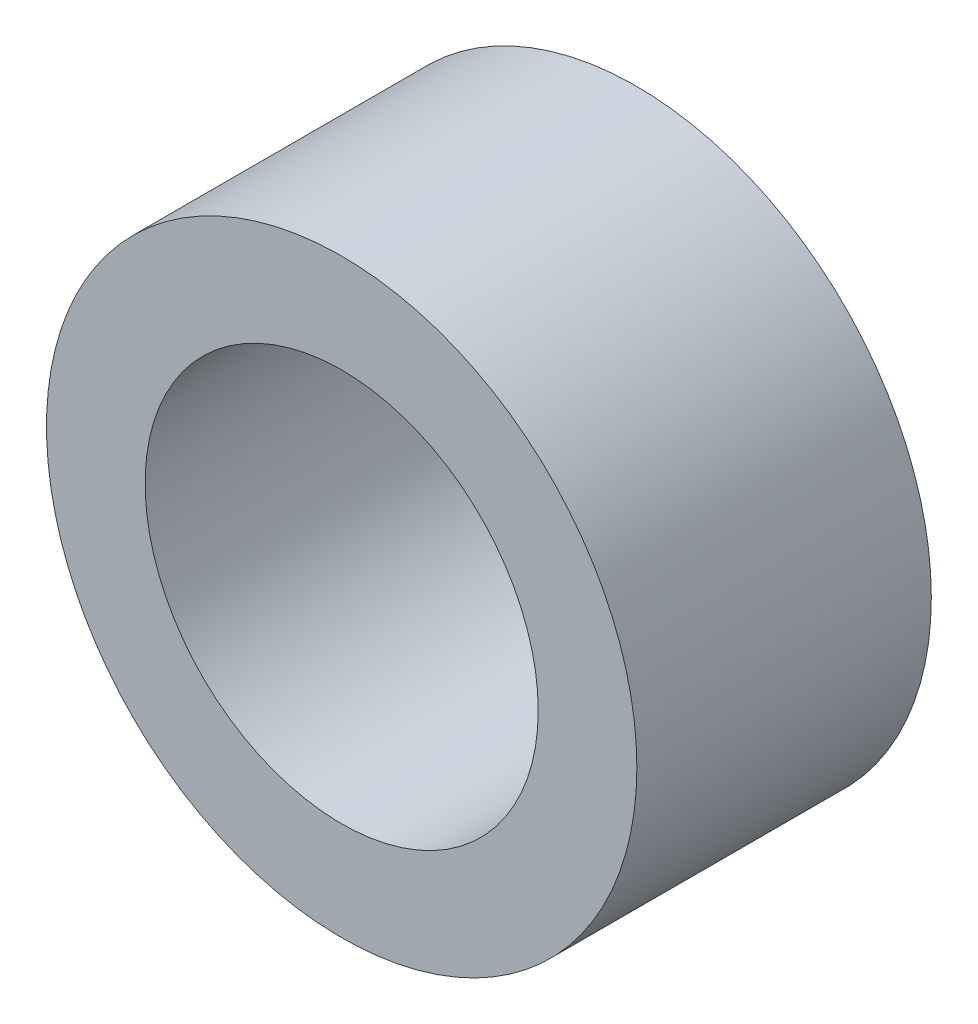
ISO-10303-21;
HEADER;
FILE_DESCRIPTION(('STEP AP214'),'2;1');
FILE_NAME('part.step','',(''),(''),'','','');
FILE_SCHEMA(('AUTOMOTIVE_DESIGN { 1 0 10303 214 1 1 1 1 }'));
ENDSEC;
DATA;
#1=APPLICATION_CONTEXT('core data for automotive mechanical design processes');
#2=APPLICATION_PROTOCOL_DEFINITION('international standard','automotive_design',2000,#1);
#3=PRODUCT_CONTEXT('',#1,'mechanical');
#4=PRODUCT('Part','Part','',(#3));
#5=PRODUCT_RELATED_PRODUCT_CATEGORY('part','',(#4));
#6=PRODUCT_DEFINITION_FORMATION('','',#4);
#7=PRODUCT_DEFINITION_CONTEXT('part definition',#1,'design');
#8=PRODUCT_DEFINITION('design','',#6,#7);
#9=PRODUCT_DEFINITION_SHAPE('','',#8);
#10=(LENGTH_UNIT() NAMED_UNIT(*) SI_UNIT(.MILLI.,.METRE.));
#11=(NAMED_UNIT(*) PLANE_ANGLE_UNIT() SI_UNIT($,.RADIAN.));
#12=(NAMED_UNIT(*) SI_UNIT($,.STERADIAN.) SOLID_ANGLE_UNIT());
#13=UNCERTAINTY_MEASURE_WITH_UNIT(LENGTH_MEASURE(1.E-05),#10,'distance_accuracy_value','');
#14=(GEOMETRIC_REPRESENTATION_CONTEXT(3) GLOBAL_UNCERTAINTY_ASSIGNED_CONTEXT((#13)) GLOBAL_UNIT_ASSIGNED_CONTEXT((#10,
#11,#12)) REPRESENTATION_CONTEXT('',''));
#15=CARTESIAN_POINT('',(0.,0.,0.));
#16=DIRECTION('',(0.,0.,1.));
#17=DIRECTION('',(1.,0.,0.));
#18=AXIS2_PLACEMENT_3D('',#15,#16,#17);
#19=CARTESIAN_POINT('',(0.,0.,3.));
#20=DIRECTION('',(0.,0.,1.));
#21=DIRECTION('',(1.,0.,0.));
#22=AXIS2_PLACEMENT_3D('',#19,#20,#21);
#23=PLANE('',#22);
#24=CARTESIAN_POINT('',(0.,0.,3.));
#25=DIRECTION('',(0.,0.,1.));
#26=DIRECTION('',(1.,0.,0.));
#27=AXIS2_PLACEMENT_3D('',#24,#25,#26);
#28=CIRCLE('',#27,6.015);
#29=CARTESIAN_POINT('',(6.015,0.,3.));
#30=VERTEX_POINT('',#29);
#31=EDGE_CURVE('E10',#30,#30,#28,.T.);
#32=ORIENTED_EDGE('',*,*,#31,.T.);
#33=EDGE_LOOP('',(#32));
#34=FACE_BOUND('',#33,.T.);
#35=CARTESIAN_POINT('',(0.,0.,3.));
#36=DIRECTION('',(0.,0.,1.));
#37=DIRECTION('',(1.,0.,0.));
#38=AXIS2_PLACEMENT_3D('',#35,#36,#37);
#39=CIRCLE('',#38,4.005);
#40=CARTESIAN_POINT('',(4.005,0.,3.));
#41=VERTEX_POINT('',#40);
#42=EDGE_CURVE('E41',#41,#41,#39,.T.);
#43=ORIENTED_EDGE('',*,*,#42,.F.);
#44=EDGE_LOOP('',(#43));
#45=FACE_BOUND('',#44,.T.);
#46=ADVANCED_FACE('F30',(#34,#45),#23,.T.);
#47=CARTESIAN_POINT('',(0.,0.,-3.));
#48=DIRECTION('',(0.,0.,1.));
#49=DIRECTION('',(1.,0.,0.));
#50=AXIS2_PLACEMENT_3D('',#47,#48,#49);
#51=PLANE('',#50);
#52=CARTESIAN_POINT('',(0.,0.,-3.));
#53=DIRECTION('',(0.,0.,1.));
#54=DIRECTION('',(1.,0.,0.));
#55=AXIS2_PLACEMENT_3D('',#52,#53,#54);
#56=CIRCLE('',#55,6.015);
#57=CARTESIAN_POINT('',(6.015,0.,-3.));
#58=VERTEX_POINT('',#57);
#59=EDGE_CURVE('E34',#58,#58,#56,.T.);
#60=ORIENTED_EDGE('',*,*,#59,.F.);
#61=EDGE_LOOP('',(#60));
#62=FACE_BOUND('',#61,.T.);
#63=CARTESIAN_POINT('',(0.,0.,-3.));
#64=DIRECTION('',(0.,0.,1.));
#65=DIRECTION('',(1.,0.,0.));
#66=AXIS2_PLACEMENT_3D('',#63,#64,#65);
#67=CIRCLE('',#66,4.005);
#68=CARTESIAN_POINT('',(4.005,0.,-3.));
#69=VERTEX_POINT('',#68);
#70=EDGE_CURVE('E43',#69,#69,#67,.T.);
#71=ORIENTED_EDGE('',*,*,#70,.T.);
#72=EDGE_LOOP('',(#71));
#73=FACE_BOUND('',#72,.T.);
#74=ADVANCED_FACE('F53',(#62,#73),#51,.F.);
#75=CARTESIAN_POINT('',(0.,0.,3.));
#76=DIRECTION('',(0.,0.,-1.));
#77=DIRECTION('',(-1.,0.,0.));
#78=AXIS2_PLACEMENT_3D('',#75,#76,#77);
#79=CYLINDRICAL_SURFACE('',#78,6.015);
#80=ORIENTED_EDGE('',*,*,#31,.F.);
#81=EDGE_LOOP('',(#80));
#82=FACE_BOUND('',#81,.T.);
#83=ORIENTED_EDGE('',*,*,#59,.T.);
#84=EDGE_LOOP('',(#83));
#85=FACE_BOUND('',#84,.T.);
#86=ADVANCED_FACE('F32',(#82,#85),#79,.T.);
#87=CARTESIAN_POINT('',(0.,0.,3.));
#88=DIRECTION('',(0.,0.,-1.));
#89=DIRECTION('',(-1.,0.,0.));
#90=AXIS2_PLACEMENT_3D('',#87,#88,#89);
#91=CYLINDRICAL_SURFACE('',#90,4.005);
#92=ORIENTED_EDGE('',*,*,#42,.T.);
#93=EDGE_LOOP('',(#92));
#94=FACE_BOUND('',#93,.T.);
#95=ORIENTED_EDGE('',*,*,#70,.F.);
#96=EDGE_LOOP('',(#95));
#97=FACE_BOUND('',#96,.T.);
#98=ADVANCED_FACE('F49',(#94,#97),#91,.F.);
#99=CLOSED_SHELL('',(#46,#74,#86,#98));
#100=MANIFOLD_SOLID_BREP('B2',#99);
#101=ADVANCED_BREP_SHAPE_REPRESENTATION('',(#18,#100),#14);
#102=SHAPE_DEFINITION_REPRESENTATION(#9,#101);
ENDSEC;
END-ISO-10303-21;
